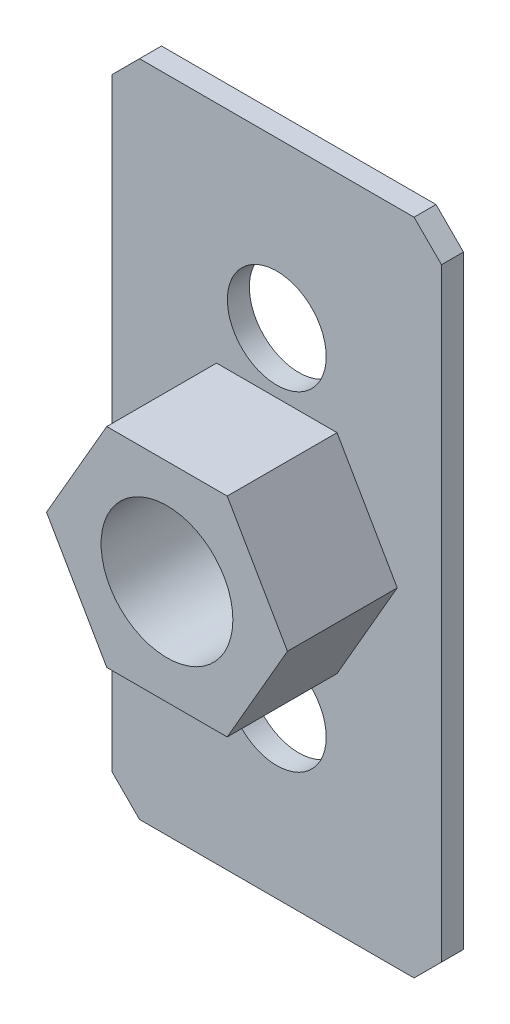
ISO-10303-21;
HEADER;
FILE_DESCRIPTION(('STEP AP214'),'2;1');
FILE_NAME('part.step','',(''),(''),'','','');
FILE_SCHEMA(('AUTOMOTIVE_DESIGN { 1 0 10303 214 1 1 1 1 }'));
ENDSEC;
DATA;
#1=APPLICATION_CONTEXT('core data for automotive mechanical design processes');
#2=APPLICATION_PROTOCOL_DEFINITION('international standard','automotive_design',2000,#1);
#3=PRODUCT_CONTEXT('',#1,'mechanical');
#4=PRODUCT('Part','Part','',(#3));
#5=PRODUCT_RELATED_PRODUCT_CATEGORY('part','',(#4));
#6=PRODUCT_DEFINITION_FORMATION('','',#4);
#7=PRODUCT_DEFINITION_CONTEXT('part definition',#1,'design');
#8=PRODUCT_DEFINITION('design','',#6,#7);
#9=PRODUCT_DEFINITION_SHAPE('','',#8);
#10=(LENGTH_UNIT() NAMED_UNIT(*) SI_UNIT(.MILLI.,.METRE.));
#11=(NAMED_UNIT(*) PLANE_ANGLE_UNIT() SI_UNIT($,.RADIAN.));
#12=(NAMED_UNIT(*) SI_UNIT($,.STERADIAN.) SOLID_ANGLE_UNIT());
#13=UNCERTAINTY_MEASURE_WITH_UNIT(LENGTH_MEASURE(1.E-05),#10,'distance_accuracy_value','');
#14=(GEOMETRIC_REPRESENTATION_CONTEXT(3) GLOBAL_UNCERTAINTY_ASSIGNED_CONTEXT((#13)) GLOBAL_UNIT_ASSIGNED_CONTEXT((#10,
#11,#12)) REPRESENTATION_CONTEXT('',''));
#15=CARTESIAN_POINT('',(0.,0.,0.));
#16=DIRECTION('',(0.,0.,1.));
#17=DIRECTION('',(1.,0.,0.));
#18=AXIS2_PLACEMENT_3D('',#15,#16,#17);
#19=CARTESIAN_POINT('',(0.,0.,0.));
#20=DIRECTION('',(0.,0.,1.));
#21=DIRECTION('',(1.,0.,0.));
#22=AXIS2_PLACEMENT_3D('',#19,#20,#21);
#23=PLANE('',#22);
#24=DIRECTION('',(-1.,0.,0.));
#25=VECTOR('',#24,1.);
#26=CARTESIAN_POINT('',(15.,30.,0.));
#27=LINE('',#26,#25);
#28=CARTESIAN_POINT('',(12.5,30.,0.));
#29=VERTEX_POINT('',#28);
#30=CARTESIAN_POINT('',(-12.5,30.,0.));
#31=VERTEX_POINT('',#30);
#32=EDGE_CURVE('E219',#29,#31,#27,.T.);
#33=ORIENTED_EDGE('',*,*,#32,.T.);
#34=DIRECTION('',(0.707106781186547,0.707106781186548,0.));
#35=VECTOR('',#34,1.);
#36=CARTESIAN_POINT('',(-21.25,21.25,0.));
#37=LINE('',#36,#35);
#38=CARTESIAN_POINT('',(-15.,27.5,0.));
#39=VERTEX_POINT('',#38);
#40=EDGE_CURVE('E260',#31,#39,#37,.F.);
#41=ORIENTED_EDGE('',*,*,#40,.T.);
#42=DIRECTION('',(0.,-1.,0.));
#43=VECTOR('',#42,1.);
#44=CARTESIAN_POINT('',(-15.,-30.,0.));
#45=LINE('',#44,#43);
#46=CARTESIAN_POINT('',(-15.,-27.5,0.));
#47=VERTEX_POINT('',#46);
#48=EDGE_CURVE('E213',#39,#47,#45,.T.);
#49=ORIENTED_EDGE('',*,*,#48,.T.);
#50=DIRECTION('',(-0.70710678118655,0.707106781186545,0.));
#51=VECTOR('',#50,1.);
#52=CARTESIAN_POINT('',(-21.2499999999999,-21.2500000000001,0.));
#53=LINE('',#52,#51);
#54=CARTESIAN_POINT('',(-12.5,-30.,0.));
#55=VERTEX_POINT('',#54);
#56=EDGE_CURVE('E257',#47,#55,#53,.F.);
#57=ORIENTED_EDGE('',*,*,#56,.T.);
#58=DIRECTION('',(1.,0.,0.));
#59=VECTOR('',#58,1.);
#60=CARTESIAN_POINT('',(15.,-30.,0.));
#61=LINE('',#60,#59);
#62=CARTESIAN_POINT('',(12.5,-30.,0.));
#63=VERTEX_POINT('',#62);
#64=EDGE_CURVE('E234',#55,#63,#61,.T.);
#65=ORIENTED_EDGE('',*,*,#64,.T.);
#66=DIRECTION('',(-0.707106781186547,-0.707106781186549,0.));
#67=VECTOR('',#66,1.);
#68=CARTESIAN_POINT('',(21.25,-21.25,0.));
#69=LINE('',#68,#67);
#70=CARTESIAN_POINT('',(15.,-27.5,0.));
#71=VERTEX_POINT('',#70);
#72=EDGE_CURVE('E254',#63,#71,#69,.F.);
#73=ORIENTED_EDGE('',*,*,#72,.T.);
#74=DIRECTION('',(0.,1.,0.));
#75=VECTOR('',#74,1.);
#76=CARTESIAN_POINT('',(15.,-30.,0.));
#77=LINE('',#76,#75);
#78=CARTESIAN_POINT('',(15.,27.5,0.));
#79=VERTEX_POINT('',#78);
#80=EDGE_CURVE('E238',#71,#79,#77,.T.);
#81=ORIENTED_EDGE('',*,*,#80,.T.);
#82=DIRECTION('',(0.70710678118655,-0.707106781186545,0.));
#83=VECTOR('',#82,1.);
#84=CARTESIAN_POINT('',(21.2499999999999,21.2500000000001,0.));
#85=LINE('',#84,#83);
#86=EDGE_CURVE('E251',#79,#29,#85,.F.);
#87=ORIENTED_EDGE('',*,*,#86,.T.);
#88=EDGE_LOOP('',(#33,#41,#49,#57,#65,#73,#81,#87));
#89=FACE_BOUND('',#88,.T.);
#90=CARTESIAN_POINT('',(0.,-15.,0.));
#91=DIRECTION('',(0.,0.,1.));
#92=DIRECTION('',(1.,0.,0.));
#93=AXIS2_PLACEMENT_3D('',#90,#91,#92);
#94=CIRCLE('',#93,4.5);
#95=CARTESIAN_POINT('',(4.5,-15.,0.));
#96=VERTEX_POINT('',#95);
#97=EDGE_CURVE('E205',#96,#96,#94,.T.);
#98=ORIENTED_EDGE('',*,*,#97,.F.);
#99=EDGE_LOOP('',(#98));
#100=FACE_BOUND('',#99,.T.);
#101=CARTESIAN_POINT('',(0.,15.,0.));
#102=DIRECTION('',(0.,0.,1.));
#103=DIRECTION('',(1.,0.,0.));
#104=AXIS2_PLACEMENT_3D('',#101,#102,#103);
#105=CIRCLE('',#104,4.5);
#106=CARTESIAN_POINT('',(4.5,15.,0.));
#107=VERTEX_POINT('',#106);
#108=EDGE_CURVE('E197',#107,#107,#105,.T.);
#109=ORIENTED_EDGE('',*,*,#108,.F.);
#110=EDGE_LOOP('',(#109));
#111=FACE_BOUND('',#110,.T.);
#112=DIRECTION('',(0.5,0.866025403784439,0.));
#113=VECTOR('',#112,1.);
#114=CARTESIAN_POINT('',(5.48482755730145,-9.49999999999999,0.));
#115=LINE('',#114,#113);
#116=CARTESIAN_POINT('',(5.48482755730145,-9.49999999999999,0.));
#117=VERTEX_POINT('',#116);
#118=CARTESIAN_POINT('',(10.9696551146029,0.,0.));
#119=VERTEX_POINT('',#118);
#120=EDGE_CURVE('E598',#117,#119,#115,.T.);
#121=ORIENTED_EDGE('',*,*,#120,.F.);
#122=DIRECTION('',(1.,0.,0.));
#123=VECTOR('',#122,1.);
#124=CARTESIAN_POINT('',(-5.48482755730145,-9.49999999999999,0.));
#125=LINE('',#124,#123);
#126=CARTESIAN_POINT('',(-5.48482755730145,-9.49999999999999,0.));
#127=VERTEX_POINT('',#126);
#128=EDGE_CURVE('E178',#127,#117,#125,.T.);
#129=ORIENTED_EDGE('',*,*,#128,.F.);
#130=DIRECTION('',(0.5,-0.866025403784439,0.));
#131=VECTOR('',#130,1.);
#132=CARTESIAN_POINT('',(-10.9696551146029,0.,0.));
#133=LINE('',#132,#131);
#134=CARTESIAN_POINT('',(-10.9696551146029,0.,0.));
#135=VERTEX_POINT('',#134);
#136=EDGE_CURVE('E174',#135,#127,#133,.T.);
#137=ORIENTED_EDGE('',*,*,#136,.F.);
#138=DIRECTION('',(-0.5,-0.866025403784439,0.));
#139=VECTOR('',#138,1.);
#140=CARTESIAN_POINT('',(-5.48482755730145,9.5,0.));
#141=LINE('',#140,#139);
#142=CARTESIAN_POINT('',(-5.48482755730145,9.5,0.));
#143=VERTEX_POINT('',#142);
#144=EDGE_CURVE('E616',#143,#135,#141,.T.);
#145=ORIENTED_EDGE('',*,*,#144,.F.);
#146=DIRECTION('',(-1.,0.,0.));
#147=VECTOR('',#146,1.);
#148=CARTESIAN_POINT('',(5.48482755730144,9.5,0.));
#149=LINE('',#148,#147);
#150=CARTESIAN_POINT('',(5.48482755730144,9.5,0.));
#151=VERTEX_POINT('',#150);
#152=EDGE_CURVE('E608',#151,#143,#149,.T.);
#153=ORIENTED_EDGE('',*,*,#152,.F.);
#154=DIRECTION('',(-0.5,0.866025403784439,0.));
#155=VECTOR('',#154,1.);
#156=CARTESIAN_POINT('',(10.9696551146029,0.,0.));
#157=LINE('',#156,#155);
#158=EDGE_CURVE('E601',#119,#151,#157,.T.);
#159=ORIENTED_EDGE('',*,*,#158,.F.);
#160=EDGE_LOOP('',(#121,#129,#137,#145,#153,#159));
#161=FACE_BOUND('',#160,.T.);
#162=ADVANCED_FACE('F49',(#89,#100,#111,#161),#23,.T.);
#163=CARTESIAN_POINT('',(-15.,-30.,-2.));
#164=DIRECTION('',(-1.,0.,0.));
#165=DIRECTION('',(0.,0.,1.));
#166=AXIS2_PLACEMENT_3D('',#163,#164,#165);
#167=PLANE('',#166);
#168=ORIENTED_EDGE('',*,*,#48,.F.);
#169=DIRECTION('',(0.,0.,-1.));
#170=VECTOR('',#169,1.);
#171=CARTESIAN_POINT('',(-15.,27.5,-2.));
#172=LINE('',#171,#170);
#173=CARTESIAN_POINT('',(-15.,27.5,-2.));
#174=VERTEX_POINT('',#173);
#175=EDGE_CURVE('E267',#39,#174,#172,.T.);
#176=ORIENTED_EDGE('',*,*,#175,.T.);
#177=DIRECTION('',(0.,-1.,0.));
#178=VECTOR('',#177,1.);
#179=CARTESIAN_POINT('',(-15.,-30.,-2.));
#180=LINE('',#179,#178);
#181=CARTESIAN_POINT('',(-15.,-27.5,-2.));
#182=VERTEX_POINT('',#181);
#183=EDGE_CURVE('E214',#174,#182,#180,.T.);
#184=ORIENTED_EDGE('',*,*,#183,.T.);
#185=DIRECTION('',(0.,0.,1.));
#186=VECTOR('',#185,1.);
#187=CARTESIAN_POINT('',(-15.,-27.5,-2.));
#188=LINE('',#187,#186);
#189=EDGE_CURVE('E263',#182,#47,#188,.T.);
#190=ORIENTED_EDGE('',*,*,#189,.T.);
#191=EDGE_LOOP('',(#168,#176,#184,#190));
#192=FACE_BOUND('',#191,.T.);
#193=ADVANCED_FACE('F316',(#192),#167,.T.);
#194=CARTESIAN_POINT('',(15.,30.,-2.));
#195=DIRECTION('',(0.,1.,0.));
#196=DIRECTION('',(-1.,0.,0.));
#197=AXIS2_PLACEMENT_3D('',#194,#195,#196);
#198=PLANE('',#197);
#199=DIRECTION('',(-1.,0.,0.));
#200=VECTOR('',#199,1.);
#201=CARTESIAN_POINT('',(15.,30.,-2.));
#202=LINE('',#201,#200);
#203=CARTESIAN_POINT('',(12.5,30.,-2.));
#204=VERTEX_POINT('',#203);
#205=CARTESIAN_POINT('',(-12.5,30.,-2.));
#206=VERTEX_POINT('',#205);
#207=EDGE_CURVE('E226',#204,#206,#202,.T.);
#208=ORIENTED_EDGE('',*,*,#207,.T.);
#209=DIRECTION('',(0.,0.,1.));
#210=VECTOR('',#209,1.);
#211=CARTESIAN_POINT('',(-12.5,30.,-2.));
#212=LINE('',#211,#210);
#213=EDGE_CURVE('E247',#206,#31,#212,.T.);
#214=ORIENTED_EDGE('',*,*,#213,.T.);
#215=ORIENTED_EDGE('',*,*,#32,.F.);
#216=DIRECTION('',(0.,0.,-1.));
#217=VECTOR('',#216,1.);
#218=CARTESIAN_POINT('',(12.5,30.,-2.));
#219=LINE('',#218,#217);
#220=EDGE_CURVE('E230',#29,#204,#219,.T.);
#221=ORIENTED_EDGE('',*,*,#220,.T.);
#222=EDGE_LOOP('',(#208,#214,#215,#221));
#223=FACE_BOUND('',#222,.T.);
#224=ADVANCED_FACE('F323',(#223),#198,.T.);
#225=CARTESIAN_POINT('',(15.,-30.,-2.));
#226=DIRECTION('',(1.,0.,0.));
#227=DIRECTION('',(0.,0.,-1.));
#228=AXIS2_PLACEMENT_3D('',#225,#226,#227);
#229=PLANE('',#228);
#230=ORIENTED_EDGE('',*,*,#80,.F.);
#231=DIRECTION('',(0.,0.,-1.));
#232=VECTOR('',#231,1.);
#233=CARTESIAN_POINT('',(15.,-27.5,-2.));
#234=LINE('',#233,#232);
#235=CARTESIAN_POINT('',(15.,-27.5,-2.));
#236=VERTEX_POINT('',#235);
#237=EDGE_CURVE('E11',#71,#236,#234,.T.);
#238=ORIENTED_EDGE('',*,*,#237,.T.);
#239=DIRECTION('',(0.,1.,0.));
#240=VECTOR('',#239,1.);
#241=CARTESIAN_POINT('',(15.,-30.,-2.));
#242=LINE('',#241,#240);
#243=CARTESIAN_POINT('',(15.,27.5,-2.));
#244=VERTEX_POINT('',#243);
#245=EDGE_CURVE('E222',#236,#244,#242,.T.);
#246=ORIENTED_EDGE('',*,*,#245,.T.);
#247=DIRECTION('',(0.,0.,1.));
#248=VECTOR('',#247,1.);
#249=CARTESIAN_POINT('',(15.,27.5,-2.));
#250=LINE('',#249,#248);
#251=EDGE_CURVE('E58',#244,#79,#250,.T.);
#252=ORIENTED_EDGE('',*,*,#251,.T.);
#253=EDGE_LOOP('',(#230,#238,#246,#252));
#254=FACE_BOUND('',#253,.T.);
#255=ADVANCED_FACE('F294',(#254),#229,.T.);
#256=CARTESIAN_POINT('',(15.,-30.,-2.));
#257=DIRECTION('',(0.,-1.,0.));
#258=DIRECTION('',(1.,0.,0.));
#259=AXIS2_PLACEMENT_3D('',#256,#257,#258);
#260=PLANE('',#259);
#261=ORIENTED_EDGE('',*,*,#64,.F.);
#262=DIRECTION('',(0.,0.,-1.));
#263=VECTOR('',#262,1.);
#264=CARTESIAN_POINT('',(-12.5,-30.,-2.));
#265=LINE('',#264,#263);
#266=CARTESIAN_POINT('',(-12.5,-30.,-2.));
#267=VERTEX_POINT('',#266);
#268=EDGE_CURVE('E285',#55,#267,#265,.T.);
#269=ORIENTED_EDGE('',*,*,#268,.T.);
#270=DIRECTION('',(1.,0.,0.));
#271=VECTOR('',#270,1.);
#272=CARTESIAN_POINT('',(15.,-30.,-2.));
#273=LINE('',#272,#271);
#274=CARTESIAN_POINT('',(12.5,-30.,-2.));
#275=VERTEX_POINT('',#274);
#276=EDGE_CURVE('E218',#267,#275,#273,.T.);
#277=ORIENTED_EDGE('',*,*,#276,.T.);
#278=DIRECTION('',(0.,0.,1.));
#279=VECTOR('',#278,1.);
#280=CARTESIAN_POINT('',(12.5,-30.,-2.));
#281=LINE('',#280,#279);
#282=EDGE_CURVE('E281',#275,#63,#281,.T.);
#283=ORIENTED_EDGE('',*,*,#282,.T.);
#284=EDGE_LOOP('',(#261,#269,#277,#283));
#285=FACE_BOUND('',#284,.T.);
#286=ADVANCED_FACE('F306',(#285),#260,.T.);
#287=CARTESIAN_POINT('',(0.,0.,-2.));
#288=DIRECTION('',(0.,0.,1.));
#289=DIRECTION('',(1.,0.,0.));
#290=AXIS2_PLACEMENT_3D('',#287,#288,#289);
#291=PLANE('',#290);
#292=CARTESIAN_POINT('',(0.,0.,-2.));
#293=DIRECTION('',(0.,0.,1.));
#294=DIRECTION('',(1.,0.,0.));
#295=AXIS2_PLACEMENT_3D('',#292,#293,#294);
#296=CIRCLE('',#295,6.5);
#297=CARTESIAN_POINT('',(6.5,0.,-2.));
#298=VERTEX_POINT('',#297);
#299=EDGE_CURVE('E188',#298,#298,#296,.T.);
#300=ORIENTED_EDGE('',*,*,#299,.T.);
#301=EDGE_LOOP('',(#300));
#302=FACE_BOUND('',#301,.T.);
#303=CARTESIAN_POINT('',(0.,15.,-2.));
#304=DIRECTION('',(0.,0.,1.));
#305=DIRECTION('',(1.,0.,0.));
#306=AXIS2_PLACEMENT_3D('',#303,#304,#305);
#307=CIRCLE('',#306,4.5);
#308=CARTESIAN_POINT('',(4.5,15.,-2.));
#309=VERTEX_POINT('',#308);
#310=EDGE_CURVE('E201',#309,#309,#307,.T.);
#311=ORIENTED_EDGE('',*,*,#310,.T.);
#312=EDGE_LOOP('',(#311));
#313=FACE_BOUND('',#312,.T.);
#314=CARTESIAN_POINT('',(0.,-15.,-2.));
#315=DIRECTION('',(0.,0.,1.));
#316=DIRECTION('',(1.,0.,0.));
#317=AXIS2_PLACEMENT_3D('',#314,#315,#316);
#318=CIRCLE('',#317,4.5);
#319=CARTESIAN_POINT('',(4.5,-15.,-2.));
#320=VERTEX_POINT('',#319);
#321=EDGE_CURVE('E209',#320,#320,#318,.T.);
#322=ORIENTED_EDGE('',*,*,#321,.T.);
#323=EDGE_LOOP('',(#322));
#324=FACE_BOUND('',#323,.T.);
#325=ORIENTED_EDGE('',*,*,#183,.F.);
#326=DIRECTION('',(-0.707106781186547,-0.707106781186548,0.));
#327=VECTOR('',#326,1.);
#328=CARTESIAN_POINT('',(-12.5,30.,-2.));
#329=LINE('',#328,#327);
#330=EDGE_CURVE('E278',#174,#206,#329,.F.);
#331=ORIENTED_EDGE('',*,*,#330,.T.);
#332=ORIENTED_EDGE('',*,*,#207,.F.);
#333=DIRECTION('',(-0.70710678118655,0.707106781186545,0.));
#334=VECTOR('',#333,1.);
#335=CARTESIAN_POINT('',(15.,27.5,-2.));
#336=LINE('',#335,#334);
#337=EDGE_CURVE('E270',#204,#244,#336,.F.);
#338=ORIENTED_EDGE('',*,*,#337,.T.);
#339=ORIENTED_EDGE('',*,*,#245,.F.);
#340=DIRECTION('',(0.707106781186547,0.707106781186549,0.));
#341=VECTOR('',#340,1.);
#342=CARTESIAN_POINT('',(12.5,-30.,-2.));
#343=LINE('',#342,#341);
#344=EDGE_CURVE('E73',#236,#275,#343,.F.);
#345=ORIENTED_EDGE('',*,*,#344,.T.);
#346=ORIENTED_EDGE('',*,*,#276,.F.);
#347=DIRECTION('',(0.70710678118655,-0.707106781186545,0.));
#348=VECTOR('',#347,1.);
#349=CARTESIAN_POINT('',(-15.,-27.5,-2.));
#350=LINE('',#349,#348);
#351=EDGE_CURVE('E275',#267,#182,#350,.F.);
#352=ORIENTED_EDGE('',*,*,#351,.T.);
#353=EDGE_LOOP('',(#325,#331,#332,#338,#339,#345,#346,#352));
#354=FACE_BOUND('',#353,.T.);
#355=ADVANCED_FACE('F310',(#302,#313,#324,#354),#291,.F.);
#356=CARTESIAN_POINT('',(0.,-15.,0.));
#357=DIRECTION('',(0.,0.,1.));
#358=DIRECTION('',(1.,0.,0.));
#359=AXIS2_PLACEMENT_3D('',#356,#357,#358);
#360=CYLINDRICAL_SURFACE('',#359,4.5);
#361=ORIENTED_EDGE('',*,*,#97,.T.);
#362=EDGE_LOOP('',(#361));
#363=FACE_BOUND('',#362,.T.);
#364=ORIENTED_EDGE('',*,*,#321,.F.);
#365=EDGE_LOOP('',(#364));
#366=FACE_BOUND('',#365,.T.);
#367=ADVANCED_FACE('F509',(#363,#366),#360,.F.);
#368=CARTESIAN_POINT('',(0.,15.,0.));
#369=DIRECTION('',(0.,0.,1.));
#370=DIRECTION('',(1.,0.,0.));
#371=AXIS2_PLACEMENT_3D('',#368,#369,#370);
#372=CYLINDRICAL_SURFACE('',#371,4.5);
#373=ORIENTED_EDGE('',*,*,#108,.T.);
#374=EDGE_LOOP('',(#373));
#375=FACE_BOUND('',#374,.T.);
#376=ORIENTED_EDGE('',*,*,#310,.F.);
#377=EDGE_LOOP('',(#376));
#378=FACE_BOUND('',#377,.T.);
#379=ADVANCED_FACE('F550',(#375,#378),#372,.F.);
#380=CARTESIAN_POINT('',(0.,0.,-10.));
#381=DIRECTION('',(0.,0.,1.));
#382=DIRECTION('',(1.,0.,0.));
#383=AXIS2_PLACEMENT_3D('',#380,#381,#382);
#384=CYLINDRICAL_SURFACE('',#383,6.5);
#385=CARTESIAN_POINT('',(0.,0.,0.));
#386=DIRECTION('',(0.,0.,1.));
#387=DIRECTION('',(1.,0.,0.));
#388=AXIS2_PLACEMENT_3D('',#385,#386,#387);
#389=CIRCLE('',#388,6.5);
#390=CARTESIAN_POINT('',(6.5,0.,0.));
#391=VERTEX_POINT('',#390);
#392=EDGE_CURVE('E181',#391,#391,#389,.F.);
#393=ORIENTED_EDGE('',*,*,#392,.F.);
#394=EDGE_LOOP('',(#393));
#395=FACE_BOUND('',#394,.T.);
#396=ORIENTED_EDGE('',*,*,#299,.F.);
#397=EDGE_LOOP('',(#396));
#398=FACE_BOUND('',#397,.T.);
#399=ADVANCED_FACE('F351',(#395,#398),#384,.F.);
#400=CARTESIAN_POINT('',(-12.5,30.,-2.));
#401=DIRECTION('',(0.707106781186548,-0.707106781186547,0.));
#402=DIRECTION('',(0.,0.,1.));
#403=AXIS2_PLACEMENT_3D('',#400,#401,#402);
#404=PLANE('',#403);
#405=ORIENTED_EDGE('',*,*,#330,.F.);
#406=ORIENTED_EDGE('',*,*,#175,.F.);
#407=ORIENTED_EDGE('',*,*,#40,.F.);
#408=ORIENTED_EDGE('',*,*,#213,.F.);
#409=EDGE_LOOP('',(#405,#406,#407,#408));
#410=FACE_BOUND('',#409,.T.);
#411=ADVANCED_FACE('F321',(#410),#404,.F.);
#412=CARTESIAN_POINT('',(-15.,-27.5,-2.));
#413=DIRECTION('',(0.707106781186545,0.70710678118655,0.));
#414=DIRECTION('',(0.,0.,1.));
#415=AXIS2_PLACEMENT_3D('',#412,#413,#414);
#416=PLANE('',#415);
#417=ORIENTED_EDGE('',*,*,#351,.F.);
#418=ORIENTED_EDGE('',*,*,#268,.F.);
#419=ORIENTED_EDGE('',*,*,#56,.F.);
#420=ORIENTED_EDGE('',*,*,#189,.F.);
#421=EDGE_LOOP('',(#417,#418,#419,#420));
#422=FACE_BOUND('',#421,.T.);
#423=ADVANCED_FACE('F313',(#422),#416,.F.);
#424=CARTESIAN_POINT('',(12.5,-30.,-2.));
#425=DIRECTION('',(-0.707106781186549,0.707106781186547,0.));
#426=DIRECTION('',(0.,0.,1.));
#427=AXIS2_PLACEMENT_3D('',#424,#425,#426);
#428=PLANE('',#427);
#429=ORIENTED_EDGE('',*,*,#344,.F.);
#430=ORIENTED_EDGE('',*,*,#237,.F.);
#431=ORIENTED_EDGE('',*,*,#72,.F.);
#432=ORIENTED_EDGE('',*,*,#282,.F.);
#433=EDGE_LOOP('',(#429,#430,#431,#432));
#434=FACE_BOUND('',#433,.T.);
#435=ADVANCED_FACE('F304',(#434),#428,.F.);
#436=CARTESIAN_POINT('',(15.,27.5,-2.));
#437=DIRECTION('',(-0.707106781186545,-0.70710678118655,0.));
#438=DIRECTION('',(0.,0.,1.));
#439=AXIS2_PLACEMENT_3D('',#436,#437,#438);
#440=PLANE('',#439);
#441=ORIENTED_EDGE('',*,*,#337,.F.);
#442=ORIENTED_EDGE('',*,*,#220,.F.);
#443=ORIENTED_EDGE('',*,*,#86,.F.);
#444=ORIENTED_EDGE('',*,*,#251,.F.);
#445=EDGE_LOOP('',(#441,#442,#443,#444));
#446=FACE_BOUND('',#445,.T.);
#447=ADVANCED_FACE('F51',(#446),#440,.F.);
#448=CARTESIAN_POINT('',(0.,0.,0.));
#449=DIRECTION('',(0.,0.,1.));
#450=DIRECTION('',(1.,0.,0.));
#451=AXIS2_PLACEMENT_3D('',#448,#449,#450);
#452=PLANE('',#451);
#453=CARTESIAN_POINT('',(0.,0.,0.));
#454=DIRECTION('',(0.,0.,1.));
#455=DIRECTION('',(1.,0.,0.));
#456=AXIS2_PLACEMENT_3D('',#453,#454,#455);
#457=CIRCLE('',#456,6.);
#458=CARTESIAN_POINT('',(6.,0.,0.));
#459=VERTEX_POINT('',#458);
#460=EDGE_CURVE('E650',#459,#459,#457,.T.);
#461=ORIENTED_EDGE('',*,*,#460,.T.);
#462=EDGE_LOOP('',(#461));
#463=FACE_BOUND('',#462,.T.);
#464=ORIENTED_EDGE('',*,*,#392,.T.);
#465=EDGE_LOOP('',(#464));
#466=FACE_BOUND('',#465,.T.);
#467=ADVANCED_FACE('F327',(#463,#466),#452,.F.);
#468=CARTESIAN_POINT('',(0.,0.,10.));
#469=DIRECTION('',(0.,0.,1.));
#470=DIRECTION('',(1.,0.,0.));
#471=AXIS2_PLACEMENT_3D('',#468,#469,#470);
#472=PLANE('',#471);
#473=DIRECTION('',(1.,0.,0.));
#474=VECTOR('',#473,1.);
#475=CARTESIAN_POINT('',(-5.48482755730145,-9.49999999999999,10.));
#476=LINE('',#475,#474);
#477=CARTESIAN_POINT('',(-5.48482755730145,-9.49999999999999,10.));
#478=VERTEX_POINT('',#477);
#479=CARTESIAN_POINT('',(5.48482755730145,-9.49999999999999,10.));
#480=VERTEX_POINT('',#479);
#481=EDGE_CURVE('E164',#478,#480,#476,.T.);
#482=ORIENTED_EDGE('',*,*,#481,.T.);
#483=DIRECTION('',(0.5,0.866025403784439,0.));
#484=VECTOR('',#483,1.);
#485=CARTESIAN_POINT('',(5.48482755730145,-9.49999999999999,10.));
#486=LINE('',#485,#484);
#487=CARTESIAN_POINT('',(10.9696551146029,0.,10.));
#488=VERTEX_POINT('',#487);
#489=EDGE_CURVE('E152',#480,#488,#486,.T.);
#490=ORIENTED_EDGE('',*,*,#489,.T.);
#491=DIRECTION('',(-0.5,0.866025403784439,0.));
#492=VECTOR('',#491,1.);
#493=CARTESIAN_POINT('',(10.9696551146029,0.,10.));
#494=LINE('',#493,#492);
#495=CARTESIAN_POINT('',(5.48482755730144,9.5,10.));
#496=VERTEX_POINT('',#495);
#497=EDGE_CURVE('E163',#488,#496,#494,.T.);
#498=ORIENTED_EDGE('',*,*,#497,.T.);
#499=DIRECTION('',(-1.,0.,0.));
#500=VECTOR('',#499,1.);
#501=CARTESIAN_POINT('',(5.48482755730144,9.5,10.));
#502=LINE('',#501,#500);
#503=CARTESIAN_POINT('',(-5.48482755730145,9.5,10.));
#504=VERTEX_POINT('',#503);
#505=EDGE_CURVE('E636',#496,#504,#502,.T.);
#506=ORIENTED_EDGE('',*,*,#505,.T.);
#507=DIRECTION('',(-0.5,-0.866025403784439,0.));
#508=VECTOR('',#507,1.);
#509=CARTESIAN_POINT('',(-5.48482755730145,9.5,10.));
#510=LINE('',#509,#508);
#511=CARTESIAN_POINT('',(-10.9696551146029,0.,10.));
#512=VERTEX_POINT('',#511);
#513=EDGE_CURVE('E639',#504,#512,#510,.T.);
#514=ORIENTED_EDGE('',*,*,#513,.T.);
#515=DIRECTION('',(0.5,-0.866025403784439,0.));
#516=VECTOR('',#515,1.);
#517=CARTESIAN_POINT('',(-10.9696551146029,0.,10.));
#518=LINE('',#517,#516);
#519=EDGE_CURVE('E169',#512,#478,#518,.T.);
#520=ORIENTED_EDGE('',*,*,#519,.T.);
#521=EDGE_LOOP('',(#482,#490,#498,#506,#514,#520));
#522=FACE_BOUND('',#521,.T.);
#523=CARTESIAN_POINT('',(0.,0.,10.));
#524=DIRECTION('',(0.,0.,1.));
#525=DIRECTION('',(1.,0.,0.));
#526=AXIS2_PLACEMENT_3D('',#523,#524,#525);
#527=CIRCLE('',#526,6.);
#528=CARTESIAN_POINT('',(6.,0.,10.));
#529=VERTEX_POINT('',#528);
#530=EDGE_CURVE('E610',#529,#529,#527,.T.);
#531=ORIENTED_EDGE('',*,*,#530,.F.);
#532=EDGE_LOOP('',(#531));
#533=FACE_BOUND('',#532,.T.);
#534=ADVANCED_FACE('F167',(#522,#533),#472,.T.);
#535=CARTESIAN_POINT('',(-5.48482755730145,-9.49999999999999,10.));
#536=DIRECTION('',(0.,1.,0.));
#537=DIRECTION('',(-1.,0.,0.));
#538=AXIS2_PLACEMENT_3D('',#535,#536,#537);
#539=PLANE('',#538);
#540=ORIENTED_EDGE('',*,*,#128,.T.);
#541=DIRECTION('',(0.,0.,-1.));
#542=VECTOR('',#541,1.);
#543=CARTESIAN_POINT('',(5.48482755730145,-9.49999999999999,10.));
#544=LINE('',#543,#542);
#545=EDGE_CURVE('E156',#480,#117,#544,.T.);
#546=ORIENTED_EDGE('',*,*,#545,.F.);
#547=ORIENTED_EDGE('',*,*,#481,.F.);
#548=DIRECTION('',(0.,0.,-1.));
#549=VECTOR('',#548,1.);
#550=CARTESIAN_POINT('',(-5.48482755730145,-9.49999999999999,10.));
#551=LINE('',#550,#549);
#552=EDGE_CURVE('E621',#478,#127,#551,.T.);
#553=ORIENTED_EDGE('',*,*,#552,.T.);
#554=EDGE_LOOP('',(#540,#546,#547,#553));
#555=FACE_BOUND('',#554,.T.);
#556=ADVANCED_FACE('F176',(#555),#539,.F.);
#557=CARTESIAN_POINT('',(5.48482755730145,-9.49999999999999,10.));
#558=DIRECTION('',(-0.866025403784439,0.5,0.));
#559=DIRECTION('',(-0.5,-0.866025403784439,0.));
#560=AXIS2_PLACEMENT_3D('',#557,#558,#559);
#561=PLANE('',#560);
#562=ORIENTED_EDGE('',*,*,#120,.T.);
#563=DIRECTION('',(0.,0.,-1.));
#564=VECTOR('',#563,1.);
#565=CARTESIAN_POINT('',(10.9696551146029,0.,10.));
#566=LINE('',#565,#564);
#567=EDGE_CURVE('E159',#488,#119,#566,.T.);
#568=ORIENTED_EDGE('',*,*,#567,.F.);
#569=ORIENTED_EDGE('',*,*,#489,.F.);
#570=ORIENTED_EDGE('',*,*,#545,.T.);
#571=EDGE_LOOP('',(#562,#568,#569,#570));
#572=FACE_BOUND('',#571,.T.);
#573=ADVANCED_FACE('F154',(#572),#561,.F.);
#574=CARTESIAN_POINT('',(10.9696551146029,0.,10.));
#575=DIRECTION('',(-0.866025403784439,-0.5,0.));
#576=DIRECTION('',(0.5,-0.866025403784439,0.));
#577=AXIS2_PLACEMENT_3D('',#574,#575,#576);
#578=PLANE('',#577);
#579=ORIENTED_EDGE('',*,*,#158,.T.);
#580=DIRECTION('',(0.,0.,-1.));
#581=VECTOR('',#580,1.);
#582=CARTESIAN_POINT('',(5.48482755730144,9.5,10.));
#583=LINE('',#582,#581);
#584=EDGE_CURVE('E190',#496,#151,#583,.T.);
#585=ORIENTED_EDGE('',*,*,#584,.F.);
#586=ORIENTED_EDGE('',*,*,#497,.F.);
#587=ORIENTED_EDGE('',*,*,#567,.T.);
#588=EDGE_LOOP('',(#579,#585,#586,#587));
#589=FACE_BOUND('',#588,.T.);
#590=ADVANCED_FACE('F401',(#589),#578,.F.);
#591=CARTESIAN_POINT('',(5.48482755730144,9.5,10.));
#592=DIRECTION('',(0.,-1.,0.));
#593=DIRECTION('',(1.,0.,0.));
#594=AXIS2_PLACEMENT_3D('',#591,#592,#593);
#595=PLANE('',#594);
#596=ORIENTED_EDGE('',*,*,#152,.T.);
#597=DIRECTION('',(0.,0.,-1.));
#598=VECTOR('',#597,1.);
#599=CARTESIAN_POINT('',(-5.48482755730145,9.5,10.));
#600=LINE('',#599,#598);
#601=EDGE_CURVE('E626',#504,#143,#600,.T.);
#602=ORIENTED_EDGE('',*,*,#601,.F.);
#603=ORIENTED_EDGE('',*,*,#505,.F.);
#604=ORIENTED_EDGE('',*,*,#584,.T.);
#605=EDGE_LOOP('',(#596,#602,#603,#604));
#606=FACE_BOUND('',#605,.T.);
#607=ADVANCED_FACE('F392',(#606),#595,.F.);
#608=CARTESIAN_POINT('',(-5.48482755730145,9.5,10.));
#609=DIRECTION('',(0.866025403784439,-0.5,0.));
#610=DIRECTION('',(0.5,0.866025403784439,0.));
#611=AXIS2_PLACEMENT_3D('',#608,#609,#610);
#612=PLANE('',#611);
#613=ORIENTED_EDGE('',*,*,#144,.T.);
#614=DIRECTION('',(0.,0.,-1.));
#615=VECTOR('',#614,1.);
#616=CARTESIAN_POINT('',(-10.9696551146029,0.,10.));
#617=LINE('',#616,#615);
#618=EDGE_CURVE('E65',#512,#135,#617,.T.);
#619=ORIENTED_EDGE('',*,*,#618,.F.);
#620=ORIENTED_EDGE('',*,*,#513,.F.);
#621=ORIENTED_EDGE('',*,*,#601,.T.);
#622=EDGE_LOOP('',(#613,#619,#620,#621));
#623=FACE_BOUND('',#622,.T.);
#624=ADVANCED_FACE('F384',(#623),#612,.F.);
#625=CARTESIAN_POINT('',(-10.9696551146029,0.,10.));
#626=DIRECTION('',(0.866025403784439,0.5,0.));
#627=DIRECTION('',(-0.5,0.866025403784439,0.));
#628=AXIS2_PLACEMENT_3D('',#625,#626,#627);
#629=PLANE('',#628);
#630=ORIENTED_EDGE('',*,*,#136,.T.);
#631=ORIENTED_EDGE('',*,*,#552,.F.);
#632=ORIENTED_EDGE('',*,*,#519,.F.);
#633=ORIENTED_EDGE('',*,*,#618,.T.);
#634=EDGE_LOOP('',(#630,#631,#632,#633));
#635=FACE_BOUND('',#634,.T.);
#636=ADVANCED_FACE('F375',(#635),#629,.F.);
#637=CARTESIAN_POINT('',(0.,0.,10.));
#638=DIRECTION('',(0.,0.,-1.));
#639=DIRECTION('',(-1.,0.,0.));
#640=AXIS2_PLACEMENT_3D('',#637,#638,#639);
#641=CYLINDRICAL_SURFACE('',#640,6.);
#642=ORIENTED_EDGE('',*,*,#530,.T.);
#643=EDGE_LOOP('',(#642));
#644=FACE_BOUND('',#643,.T.);
#645=ORIENTED_EDGE('',*,*,#460,.F.);
#646=EDGE_LOOP('',(#645));
#647=FACE_BOUND('',#646,.T.);
#648=ADVANCED_FACE('F370',(#644,#647),#641,.F.);
#649=CLOSED_SHELL('',(#162,#193,#224,#255,#286,#355,#367,#379,#399,#411,#423,#435,#447,#467,
#534,#556,#573,#590,#607,#624,#636,#648));
#650=MANIFOLD_SOLID_BREP('B2',#649);
#651=ADVANCED_BREP_SHAPE_REPRESENTATION('',(#18,#650),#14);
#652=SHAPE_DEFINITION_REPRESENTATION(#9,#651);
ENDSEC;
END-ISO-10303-21;
